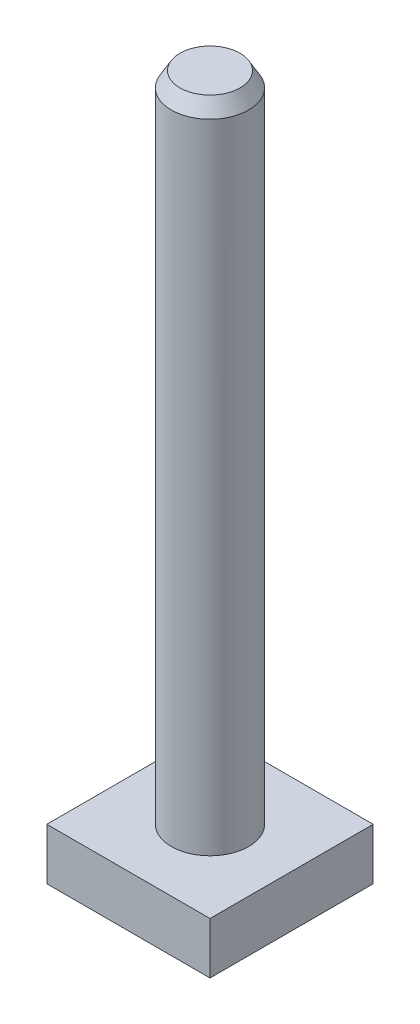
ISO-10303-21;
HEADER;
FILE_DESCRIPTION(('STEP AP214'),'2;1');
FILE_NAME('part.step','',(''),(''),'','','');
FILE_SCHEMA(('AUTOMOTIVE_DESIGN { 1 0 10303 214 1 1 1 1 }'));
ENDSEC;
DATA;
#1=APPLICATION_CONTEXT('core data for automotive mechanical design processes');
#2=APPLICATION_PROTOCOL_DEFINITION('international standard','automotive_design',2000,#1);
#3=PRODUCT_CONTEXT('',#1,'mechanical');
#4=PRODUCT('Part','Part','',(#3));
#5=PRODUCT_RELATED_PRODUCT_CATEGORY('part','',(#4));
#6=PRODUCT_DEFINITION_FORMATION('','',#4);
#7=PRODUCT_DEFINITION_CONTEXT('part definition',#1,'design');
#8=PRODUCT_DEFINITION('design','',#6,#7);
#9=PRODUCT_DEFINITION_SHAPE('','',#8);
#10=(LENGTH_UNIT() NAMED_UNIT(*) SI_UNIT(.MILLI.,.METRE.));
#11=(NAMED_UNIT(*) PLANE_ANGLE_UNIT() SI_UNIT($,.RADIAN.));
#12=(NAMED_UNIT(*) SI_UNIT($,.STERADIAN.) SOLID_ANGLE_UNIT());
#13=UNCERTAINTY_MEASURE_WITH_UNIT(LENGTH_MEASURE(1.E-05),#10,'distance_accuracy_value','');
#14=(GEOMETRIC_REPRESENTATION_CONTEXT(3) GLOBAL_UNCERTAINTY_ASSIGNED_CONTEXT((#13)) GLOBAL_UNIT_ASSIGNED_CONTEXT((#10,
#11,#12)) REPRESENTATION_CONTEXT('',''));
#15=CARTESIAN_POINT('',(0.,0.,0.));
#16=DIRECTION('',(0.,0.,1.));
#17=DIRECTION('',(1.,0.,0.));
#18=AXIS2_PLACEMENT_3D('',#15,#16,#17);
#19=CARTESIAN_POINT('',(0.,0.,0.));
#20=DIRECTION('',(0.,-1.,0.));
#21=DIRECTION('',(0.,0.,-1.));
#22=AXIS2_PLACEMENT_3D('',#19,#20,#21);
#23=CYLINDRICAL_SURFACE('',#22,4.49999999999999);
#24=CARTESIAN_POINT('',(0.,74.2679491924311,0.));
#25=DIRECTION('',(0.,1.,0.));
#26=DIRECTION('',(0.,0.,1.));
#27=AXIS2_PLACEMENT_3D('',#24,#25,#26);
#28=CIRCLE('',#27,4.49999999999999);
#29=CARTESIAN_POINT('',(0.,74.2679491924311,4.49999999999999));
#30=VERTEX_POINT('',#29);
#31=EDGE_CURVE('E42',#30,#30,#28,.F.);
#32=ORIENTED_EDGE('',*,*,#31,.T.);
#33=EDGE_LOOP('',(#32));
#34=FACE_BOUND('',#33,.T.);
#35=CARTESIAN_POINT('',(0.,0.,0.));
#36=DIRECTION('',(0.,-1.,0.));
#37=DIRECTION('',(0.,0.,-1.));
#38=AXIS2_PLACEMENT_3D('',#35,#36,#37);
#39=CIRCLE('',#38,4.5);
#40=CARTESIAN_POINT('',(0.,0.,-4.5));
#41=VERTEX_POINT('',#40);
#42=EDGE_CURVE('E110',#41,#41,#39,.T.);
#43=ORIENTED_EDGE('',*,*,#42,.F.);
#44=EDGE_LOOP('',(#43));
#45=FACE_BOUND('',#44,.T.);
#46=ADVANCED_FACE('F33',(#34,#45),#23,.T.);
#47=CARTESIAN_POINT('',(4.49999999999999,76.,0.));
#48=DIRECTION('',(0.,1.,0.));
#49=DIRECTION('',(0.,0.,1.));
#50=AXIS2_PLACEMENT_3D('',#47,#48,#49);
#51=PLANE('',#50);
#52=CARTESIAN_POINT('',(0.,76.,0.));
#53=DIRECTION('',(0.,1.,0.));
#54=DIRECTION('',(0.,0.,1.));
#55=AXIS2_PLACEMENT_3D('',#52,#53,#54);
#56=CIRCLE('',#55,3.50000000000001);
#57=CARTESIAN_POINT('',(0.,76.,3.50000000000001));
#58=VERTEX_POINT('',#57);
#59=EDGE_CURVE('E11',#58,#58,#56,.T.);
#60=ORIENTED_EDGE('',*,*,#59,.T.);
#61=EDGE_LOOP('',(#60));
#62=FACE_BOUND('',#61,.T.);
#63=ADVANCED_FACE('F129',(#62),#51,.T.);
#64=CARTESIAN_POINT('',(9.5,-6.,-9.5));
#65=DIRECTION('',(1.,0.,0.));
#66=DIRECTION('',(0.,0.,-1.));
#67=AXIS2_PLACEMENT_3D('',#64,#65,#66);
#68=PLANE('',#67);
#69=DIRECTION('',(0.,0.,-1.));
#70=VECTOR('',#69,1.);
#71=CARTESIAN_POINT('',(9.5,0.,-9.5));
#72=LINE('',#71,#70);
#73=CARTESIAN_POINT('',(9.5,0.,9.5));
#74=VERTEX_POINT('',#73);
#75=CARTESIAN_POINT('',(9.5,0.,-9.5));
#76=VERTEX_POINT('',#75);
#77=EDGE_CURVE('E101',#74,#76,#72,.T.);
#78=ORIENTED_EDGE('',*,*,#77,.F.);
#79=DIRECTION('',(0.,1.,0.));
#80=VECTOR('',#79,1.);
#81=CARTESIAN_POINT('',(9.5,-6.,9.5));
#82=LINE('',#81,#80);
#83=CARTESIAN_POINT('',(9.5,-6.,9.5));
#84=VERTEX_POINT('',#83);
#85=EDGE_CURVE('E50',#84,#74,#82,.T.);
#86=ORIENTED_EDGE('',*,*,#85,.F.);
#87=DIRECTION('',(0.,0.,-1.));
#88=VECTOR('',#87,1.);
#89=CARTESIAN_POINT('',(9.5,-6.,-9.5));
#90=LINE('',#89,#88);
#91=CARTESIAN_POINT('',(9.5,-6.,-9.5));
#92=VERTEX_POINT('',#91);
#93=EDGE_CURVE('E95',#84,#92,#90,.T.);
#94=ORIENTED_EDGE('',*,*,#93,.T.);
#95=DIRECTION('',(0.,1.,0.));
#96=VECTOR('',#95,1.);
#97=CARTESIAN_POINT('',(9.5,-6.,-9.5));
#98=LINE('',#97,#96);
#99=EDGE_CURVE('E78',#92,#76,#98,.T.);
#100=ORIENTED_EDGE('',*,*,#99,.T.);
#101=EDGE_LOOP('',(#78,#86,#94,#100));
#102=FACE_BOUND('',#101,.T.);
#103=ADVANCED_FACE('F133',(#102),#68,.T.);
#104=CARTESIAN_POINT('',(-9.5,-6.,9.5));
#105=DIRECTION('',(0.,0.,1.));
#106=DIRECTION('',(1.,0.,0.));
#107=AXIS2_PLACEMENT_3D('',#104,#105,#106);
#108=PLANE('',#107);
#109=DIRECTION('',(1.,0.,0.));
#110=VECTOR('',#109,1.);
#111=CARTESIAN_POINT('',(-9.5,0.,9.5));
#112=LINE('',#111,#110);
#113=CARTESIAN_POINT('',(-9.5,0.,9.5));
#114=VERTEX_POINT('',#113);
#115=EDGE_CURVE('E97',#114,#74,#112,.T.);
#116=ORIENTED_EDGE('',*,*,#115,.F.);
#117=DIRECTION('',(0.,1.,0.));
#118=VECTOR('',#117,1.);
#119=CARTESIAN_POINT('',(-9.5,-6.,9.5));
#120=LINE('',#119,#118);
#121=CARTESIAN_POINT('',(-9.5,-6.,9.5));
#122=VERTEX_POINT('',#121);
#123=EDGE_CURVE('E67',#122,#114,#120,.T.);
#124=ORIENTED_EDGE('',*,*,#123,.F.);
#125=DIRECTION('',(1.,0.,0.));
#126=VECTOR('',#125,1.);
#127=CARTESIAN_POINT('',(-9.5,-6.,9.5));
#128=LINE('',#127,#126);
#129=EDGE_CURVE('E92',#122,#84,#128,.T.);
#130=ORIENTED_EDGE('',*,*,#129,.T.);
#131=ORIENTED_EDGE('',*,*,#85,.T.);
#132=EDGE_LOOP('',(#116,#124,#130,#131));
#133=FACE_BOUND('',#132,.T.);
#134=ADVANCED_FACE('F139',(#133),#108,.T.);
#135=CARTESIAN_POINT('',(-9.5,-6.,-9.5));
#136=DIRECTION('',(-1.,0.,0.));
#137=DIRECTION('',(0.,0.,1.));
#138=AXIS2_PLACEMENT_3D('',#135,#136,#137);
#139=PLANE('',#138);
#140=DIRECTION('',(0.,0.,1.));
#141=VECTOR('',#140,1.);
#142=CARTESIAN_POINT('',(-9.5,0.,-9.5));
#143=LINE('',#142,#141);
#144=CARTESIAN_POINT('',(-9.5,0.,-9.5));
#145=VERTEX_POINT('',#144);
#146=EDGE_CURVE('E86',#145,#114,#143,.T.);
#147=ORIENTED_EDGE('',*,*,#146,.F.);
#148=DIRECTION('',(0.,1.,0.));
#149=VECTOR('',#148,1.);
#150=CARTESIAN_POINT('',(-9.5,-6.,-9.5));
#151=LINE('',#150,#149);
#152=CARTESIAN_POINT('',(-9.5,-6.,-9.5));
#153=VERTEX_POINT('',#152);
#154=EDGE_CURVE('E81',#153,#145,#151,.T.);
#155=ORIENTED_EDGE('',*,*,#154,.F.);
#156=DIRECTION('',(0.,0.,1.));
#157=VECTOR('',#156,1.);
#158=CARTESIAN_POINT('',(-9.5,-6.,-9.5));
#159=LINE('',#158,#157);
#160=EDGE_CURVE('E84',#153,#122,#159,.T.);
#161=ORIENTED_EDGE('',*,*,#160,.T.);
#162=ORIENTED_EDGE('',*,*,#123,.T.);
#163=EDGE_LOOP('',(#147,#155,#161,#162));
#164=FACE_BOUND('',#163,.T.);
#165=ADVANCED_FACE('F83',(#164),#139,.T.);
#166=CARTESIAN_POINT('',(-9.5,-6.,-9.5));
#167=DIRECTION('',(0.,0.,-1.));
#168=DIRECTION('',(-1.,0.,0.));
#169=AXIS2_PLACEMENT_3D('',#166,#167,#168);
#170=PLANE('',#169);
#171=DIRECTION('',(-1.,0.,0.));
#172=VECTOR('',#171,1.);
#173=CARTESIAN_POINT('',(-9.5,0.,-9.5));
#174=LINE('',#173,#172);
#175=EDGE_CURVE('E104',#76,#145,#174,.T.);
#176=ORIENTED_EDGE('',*,*,#175,.F.);
#177=ORIENTED_EDGE('',*,*,#99,.F.);
#178=DIRECTION('',(-1.,0.,0.));
#179=VECTOR('',#178,1.);
#180=CARTESIAN_POINT('',(-9.5,-6.,-9.5));
#181=LINE('',#180,#179);
#182=EDGE_CURVE('E91',#92,#153,#181,.T.);
#183=ORIENTED_EDGE('',*,*,#182,.T.);
#184=ORIENTED_EDGE('',*,*,#154,.T.);
#185=EDGE_LOOP('',(#176,#177,#183,#184));
#186=FACE_BOUND('',#185,.T.);
#187=ADVANCED_FACE('F94',(#186),#170,.T.);
#188=CARTESIAN_POINT('',(0.,-6.,0.));
#189=DIRECTION('',(0.,1.,0.));
#190=DIRECTION('',(0.,0.,1.));
#191=AXIS2_PLACEMENT_3D('',#188,#189,#190);
#192=PLANE('',#191);
#193=ORIENTED_EDGE('',*,*,#93,.F.);
#194=ORIENTED_EDGE('',*,*,#129,.F.);
#195=ORIENTED_EDGE('',*,*,#160,.F.);
#196=ORIENTED_EDGE('',*,*,#182,.F.);
#197=EDGE_LOOP('',(#193,#194,#195,#196));
#198=FACE_BOUND('',#197,.T.);
#199=ADVANCED_FACE('F90',(#198),#192,.F.);
#200=CARTESIAN_POINT('',(0.,0.,0.));
#201=DIRECTION('',(0.,1.,0.));
#202=DIRECTION('',(0.,0.,1.));
#203=AXIS2_PLACEMENT_3D('',#200,#201,#202);
#204=PLANE('',#203);
#205=ORIENTED_EDGE('',*,*,#42,.T.);
#206=EDGE_LOOP('',(#205));
#207=FACE_BOUND('',#206,.T.);
#208=ORIENTED_EDGE('',*,*,#77,.T.);
#209=ORIENTED_EDGE('',*,*,#175,.T.);
#210=ORIENTED_EDGE('',*,*,#146,.T.);
#211=ORIENTED_EDGE('',*,*,#115,.T.);
#212=EDGE_LOOP('',(#208,#209,#210,#211));
#213=FACE_BOUND('',#212,.T.);
#214=ADVANCED_FACE('F120',(#207,#213),#204,.T.);
#215=CARTESIAN_POINT('',(0.,74.2679491924311,0.));
#216=DIRECTION('',(0.,-1.,0.));
#217=DIRECTION('',(0.,0.,-1.));
#218=AXIS2_PLACEMENT_3D('',#215,#216,#217);
#219=CONICAL_SURFACE('',#218,4.49999999999999,0.523598775598296);
#220=ORIENTED_EDGE('',*,*,#59,.F.);
#221=EDGE_LOOP('',(#220));
#222=FACE_BOUND('',#221,.T.);
#223=ORIENTED_EDGE('',*,*,#31,.F.);
#224=EDGE_LOOP('',(#223));
#225=FACE_BOUND('',#224,.T.);
#226=ADVANCED_FACE('F35',(#222,#225),#219,.T.);
#227=CLOSED_SHELL('',(#46,#63,#103,#134,#165,#187,#199,#214,#226));
#228=MANIFOLD_SOLID_BREP('B2',#227);
#229=ADVANCED_BREP_SHAPE_REPRESENTATION('',(#18,#228),#14);
#230=SHAPE_DEFINITION_REPRESENTATION(#9,#229);
ENDSEC;
END-ISO-10303-21;
